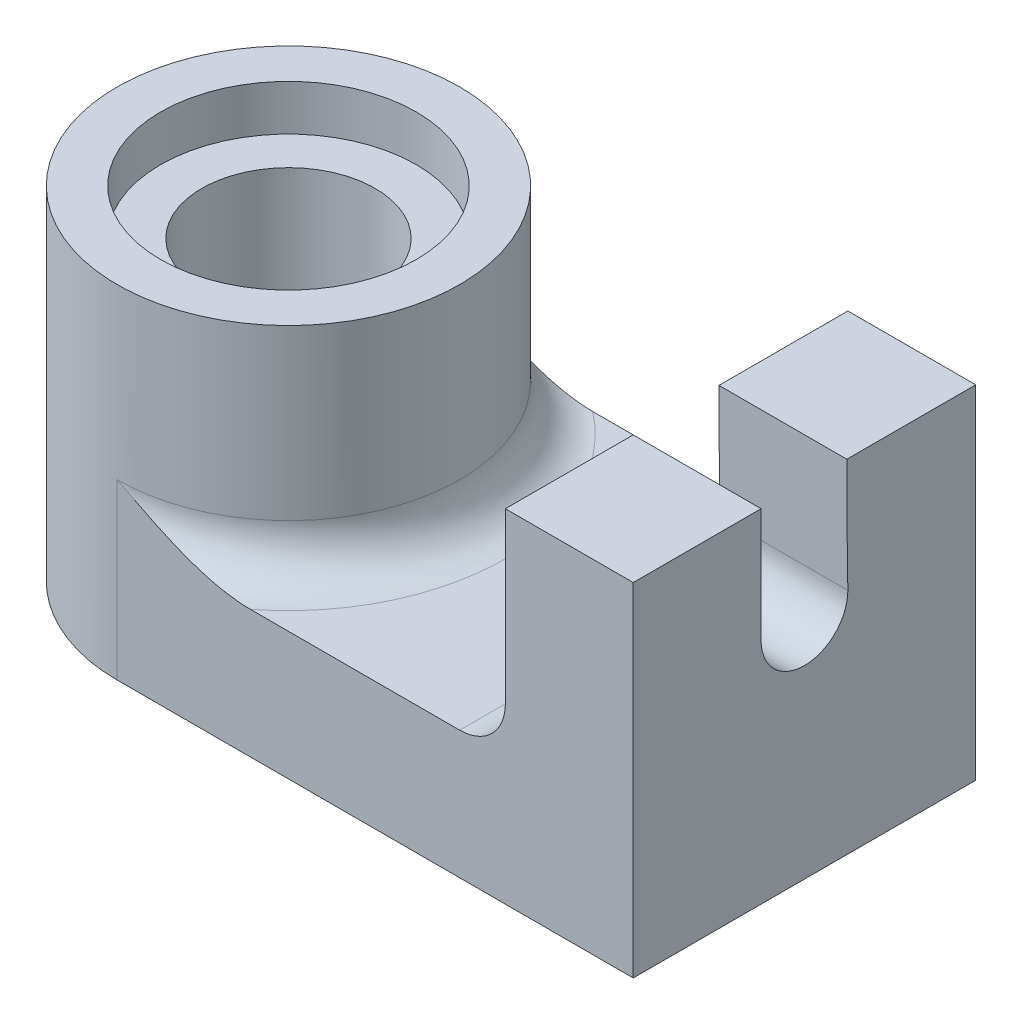
ISO-10303-21;
HEADER;
FILE_DESCRIPTION(('STEP AP214'),'2;1');
FILE_NAME('part.step','',(''),(''),'','','');
FILE_SCHEMA(('AUTOMOTIVE_DESIGN { 1 0 10303 214 1 1 1 1 }'));
ENDSEC;
DATA;
#1=APPLICATION_CONTEXT('core data for automotive mechanical design processes');
#2=APPLICATION_PROTOCOL_DEFINITION('international standard','automotive_design',2000,#1);
#3=PRODUCT_CONTEXT('',#1,'mechanical');
#4=PRODUCT('Part','Part','',(#3));
#5=PRODUCT_RELATED_PRODUCT_CATEGORY('part','',(#4));
#6=PRODUCT_DEFINITION_FORMATION('','',#4);
#7=PRODUCT_DEFINITION_CONTEXT('part definition',#1,'design');
#8=PRODUCT_DEFINITION('design','',#6,#7);
#9=PRODUCT_DEFINITION_SHAPE('','',#8);
#10=(LENGTH_UNIT() NAMED_UNIT(*) SI_UNIT(.MILLI.,.METRE.));
#11=(NAMED_UNIT(*) PLANE_ANGLE_UNIT() SI_UNIT($,.RADIAN.));
#12=(NAMED_UNIT(*) SI_UNIT($,.STERADIAN.) SOLID_ANGLE_UNIT());
#13=UNCERTAINTY_MEASURE_WITH_UNIT(LENGTH_MEASURE(1.E-05),#10,'distance_accuracy_value','');
#14=(GEOMETRIC_REPRESENTATION_CONTEXT(3) GLOBAL_UNCERTAINTY_ASSIGNED_CONTEXT((#13)) GLOBAL_UNIT_ASSIGNED_CONTEXT((#10,
#11,#12)) REPRESENTATION_CONTEXT('',''));
#15=CARTESIAN_POINT('',(0.,0.,0.));
#16=DIRECTION('',(0.,0.,1.));
#17=DIRECTION('',(1.,0.,0.));
#18=AXIS2_PLACEMENT_3D('',#15,#16,#17);
#19=CARTESIAN_POINT('',(0.,75.,0.));
#20=DIRECTION('',(0.,-1.,0.));
#21=DIRECTION('',(0.,0.,-1.));
#22=AXIS2_PLACEMENT_3D('',#19,#20,#21);
#23=CYLINDRICAL_SURFACE('',#22,19.);
#24=CARTESIAN_POINT('',(0.,65.,0.));
#25=DIRECTION('',(0.,1.,0.));
#26=DIRECTION('',(0.,0.,1.));
#27=AXIS2_PLACEMENT_3D('',#24,#25,#26);
#28=CIRCLE('',#27,19.);
#29=CARTESIAN_POINT('',(18.3303027798234,65.,5.));
#30=VERTEX_POINT('',#29);
#31=CARTESIAN_POINT('',(18.3303027798234,65.,-5.));
#32=VERTEX_POINT('',#31);
#33=EDGE_CURVE('E179',#30,#32,#28,.F.);
#34=ORIENTED_EDGE('',*,*,#33,.F.);
#35=DIRECTION('',(0.,1.,0.));
#36=VECTOR('',#35,1.);
#37=CARTESIAN_POINT('',(18.3303027798234,-35.,5.));
#38=LINE('',#37,#36);
#39=CARTESIAN_POINT('',(18.3303027798234,9.99999999999999,5.));
#40=VERTEX_POINT('',#39);
#41=EDGE_CURVE('E188',#40,#30,#38,.T.);
#42=ORIENTED_EDGE('',*,*,#41,.F.);
#43=CARTESIAN_POINT('',(0.,9.99999999999999,0.));
#44=DIRECTION('',(0.,-1.,0.));
#45=DIRECTION('',(0.,0.,-1.));
#46=AXIS2_PLACEMENT_3D('',#43,#44,#45);
#47=CIRCLE('',#46,19.);
#48=CARTESIAN_POINT('',(18.3303027798234,9.99999999999999,-5.));
#49=VERTEX_POINT('',#48);
#50=EDGE_CURVE('E197',#49,#40,#47,.F.);
#51=ORIENTED_EDGE('',*,*,#50,.F.);
#52=DIRECTION('',(0.,1.,0.));
#53=VECTOR('',#52,1.);
#54=CARTESIAN_POINT('',(18.3303027798234,-35.,-5.));
#55=LINE('',#54,#53);
#56=EDGE_CURVE('E57',#49,#32,#55,.T.);
#57=ORIENTED_EDGE('',*,*,#56,.T.);
#58=EDGE_LOOP('',(#34,#42,#51,#57));
#59=FACE_BOUND('',#58,.T.);
#60=ADVANCED_FACE('F40',(#59),#23,.F.);
#61=CARTESIAN_POINT('',(113.,0.,37.5));
#62=DIRECTION('',(-1.,0.,0.));
#63=DIRECTION('',(0.,0.,1.));
#64=AXIS2_PLACEMENT_3D('',#61,#62,#63);
#65=PLANE('',#64);
#66=CARTESIAN_POINT('',(113.,75.,-1401.91064311715));
#67=DIRECTION('',(1.,0.,0.));
#68=DIRECTION('',(0.,0.,-1.));
#69=AXIS2_PLACEMENT_3D('',#66,#67,#68);
#70=CIRCLE('',#69,1392.63505595181);
#71=CARTESIAN_POINT('',(113.,75.,-9.27558716533494));
#72=VERTEX_POINT('',#71);
#73=CARTESIAN_POINT('',(113.,49.999999999996,-9.5));
#74=VERTEX_POINT('',#73);
#75=EDGE_CURVE('E213',#72,#74,#70,.T.);
#76=ORIENTED_EDGE('',*,*,#75,.T.);
#77=CARTESIAN_POINT('',(113.,50.,0.));
#78=DIRECTION('',(1.,0.,0.));
#79=DIRECTION('',(0.,0.,-1.));
#80=AXIS2_PLACEMENT_3D('',#77,#78,#79);
#81=CIRCLE('',#80,9.5);
#82=CARTESIAN_POINT('',(113.,50.,9.5));
#83=VERTEX_POINT('',#82);
#84=EDGE_CURVE('E225',#83,#74,#81,.T.);
#85=ORIENTED_EDGE('',*,*,#84,.F.);
#86=DIRECTION('',(0.,-1.,0.));
#87=VECTOR('',#86,1.);
#88=CARTESIAN_POINT('',(113.,0.,9.49999999999999));
#89=LINE('',#88,#87);
#90=CARTESIAN_POINT('',(113.,75.,9.5));
#91=VERTEX_POINT('',#90);
#92=EDGE_CURVE('E221',#91,#83,#89,.T.);
#93=ORIENTED_EDGE('',*,*,#92,.F.);
#94=DIRECTION('',(0.,0.,-1.));
#95=VECTOR('',#94,1.);
#96=CARTESIAN_POINT('',(113.,75.,37.5));
#97=LINE('',#96,#95);
#98=CARTESIAN_POINT('',(113.,75.,37.5));
#99=VERTEX_POINT('',#98);
#100=EDGE_CURVE('E290',#99,#91,#97,.T.);
#101=ORIENTED_EDGE('',*,*,#100,.F.);
#102=DIRECTION('',(0.,1.,0.));
#103=VECTOR('',#102,1.);
#104=CARTESIAN_POINT('',(113.,0.,37.5));
#105=LINE('',#104,#103);
#106=CARTESIAN_POINT('',(113.,0.,37.5));
#107=VERTEX_POINT('',#106);
#108=EDGE_CURVE('E249',#107,#99,#105,.T.);
#109=ORIENTED_EDGE('',*,*,#108,.F.);
#110=DIRECTION('',(0.,0.,-1.));
#111=VECTOR('',#110,1.);
#112=CARTESIAN_POINT('',(113.,0.,37.5));
#113=LINE('',#112,#111);
#114=CARTESIAN_POINT('',(113.,0.,-37.5));
#115=VERTEX_POINT('',#114);
#116=EDGE_CURVE('E294',#107,#115,#113,.T.);
#117=ORIENTED_EDGE('',*,*,#116,.T.);
#118=DIRECTION('',(0.,1.,0.));
#119=VECTOR('',#118,1.);
#120=CARTESIAN_POINT('',(113.,0.,-37.5));
#121=LINE('',#120,#119);
#122=CARTESIAN_POINT('',(113.,75.,-37.5));
#123=VERTEX_POINT('',#122);
#124=EDGE_CURVE('E270',#115,#123,#121,.T.);
#125=ORIENTED_EDGE('',*,*,#124,.T.);
#126=EDGE_CURVE('E289',#72,#123,#97,.T.);
#127=ORIENTED_EDGE('',*,*,#126,.F.);
#128=EDGE_LOOP('',(#76,#85,#93,#101,#109,#117,#125,#127));
#129=FACE_BOUND('',#128,.T.);
#130=ADVANCED_FACE('F375',(#129),#65,.F.);
#131=CARTESIAN_POINT('',(113.,75.,37.5));
#132=DIRECTION('',(0.,-1.,0.));
#133=DIRECTION('',(0.,0.,-1.));
#134=AXIS2_PLACEMENT_3D('',#131,#132,#133);
#135=PLANE('',#134);
#136=DIRECTION('',(1.,0.,0.));
#137=VECTOR('',#136,1.);
#138=CARTESIAN_POINT('',(38.,75.,-9.27558716533494));
#139=LINE('',#138,#137);
#140=CARTESIAN_POINT('',(85.,75.,-9.27558716533494));
#141=VERTEX_POINT('',#140);
#142=EDGE_CURVE('E229',#141,#72,#139,.T.);
#143=ORIENTED_EDGE('',*,*,#142,.T.);
#144=ORIENTED_EDGE('',*,*,#126,.T.);
#145=DIRECTION('',(-1.,0.,0.));
#146=VECTOR('',#145,1.);
#147=CARTESIAN_POINT('',(113.,75.,-37.5));
#148=LINE('',#147,#146);
#149=CARTESIAN_POINT('',(85.,75.,-37.5));
#150=VERTEX_POINT('',#149);
#151=EDGE_CURVE('E274',#123,#150,#148,.T.);
#152=ORIENTED_EDGE('',*,*,#151,.T.);
#153=DIRECTION('',(0.,0.,-1.));
#154=VECTOR('',#153,1.);
#155=CARTESIAN_POINT('',(85.,75.,37.5));
#156=LINE('',#155,#154);
#157=EDGE_CURVE('E263',#141,#150,#156,.T.);
#158=ORIENTED_EDGE('',*,*,#157,.F.);
#159=EDGE_LOOP('',(#143,#144,#152,#158));
#160=FACE_BOUND('',#159,.T.);
#161=ADVANCED_FACE('F370',(#160),#135,.F.);
#162=CARTESIAN_POINT('',(85.,75.,37.5));
#163=DIRECTION('',(1.,0.,0.));
#164=DIRECTION('',(0.,0.,-1.));
#165=AXIS2_PLACEMENT_3D('',#162,#163,#164);
#166=PLANE('',#165);
#167=DIRECTION('',(0.,-1.,0.));
#168=VECTOR('',#167,1.);
#169=CARTESIAN_POINT('',(85.,75.,-37.5));
#170=LINE('',#169,#168);
#171=CARTESIAN_POINT('',(85.,38.,-37.5));
#172=VERTEX_POINT('',#171);
#173=EDGE_CURVE('E278',#150,#172,#170,.T.);
#174=ORIENTED_EDGE('',*,*,#173,.T.);
#175=DIRECTION('',(0.,0.,-1.));
#176=VECTOR('',#175,1.);
#177=CARTESIAN_POINT('',(85.,38.,37.5));
#178=LINE('',#177,#176);
#179=CARTESIAN_POINT('',(85.,38.,37.5));
#180=VERTEX_POINT('',#179);
#181=EDGE_CURVE('E322',#172,#180,#178,.F.);
#182=ORIENTED_EDGE('',*,*,#181,.T.);
#183=DIRECTION('',(0.,-1.,0.));
#184=VECTOR('',#183,1.);
#185=CARTESIAN_POINT('',(85.,75.,37.5));
#186=LINE('',#185,#184);
#187=CARTESIAN_POINT('',(85.,75.,37.5));
#188=VERTEX_POINT('',#187);
#189=EDGE_CURVE('E255',#188,#180,#186,.T.);
#190=ORIENTED_EDGE('',*,*,#189,.F.);
#191=CARTESIAN_POINT('',(85.,75.,9.5));
#192=VERTEX_POINT('',#191);
#193=EDGE_CURVE('E285',#188,#192,#156,.T.);
#194=ORIENTED_EDGE('',*,*,#193,.T.);
#195=DIRECTION('',(0.,-1.,0.));
#196=VECTOR('',#195,1.);
#197=CARTESIAN_POINT('',(85.,75.,9.5));
#198=LINE('',#197,#196);
#199=CARTESIAN_POINT('',(85.,50.,9.49999999999999));
#200=VERTEX_POINT('',#199);
#201=EDGE_CURVE('E298',#192,#200,#198,.T.);
#202=ORIENTED_EDGE('',*,*,#201,.T.);
#203=CARTESIAN_POINT('',(85.,50.,0.));
#204=DIRECTION('',(1.,0.,0.));
#205=DIRECTION('',(0.,0.,-1.));
#206=AXIS2_PLACEMENT_3D('',#203,#204,#205);
#207=CIRCLE('',#206,9.5);
#208=CARTESIAN_POINT('',(85.,49.999999999996,-9.5));
#209=VERTEX_POINT('',#208);
#210=EDGE_CURVE('E302',#200,#209,#207,.T.);
#211=ORIENTED_EDGE('',*,*,#210,.T.);
#212=CARTESIAN_POINT('',(85.,75.,-1401.91064311715));
#213=DIRECTION('',(1.,0.,0.));
#214=DIRECTION('',(0.,0.,-1.));
#215=AXIS2_PLACEMENT_3D('',#212,#213,#214);
#216=CIRCLE('',#215,1392.63505595181);
#217=EDGE_CURVE('E306',#141,#209,#216,.T.);
#218=ORIENTED_EDGE('',*,*,#217,.F.);
#219=ORIENTED_EDGE('',*,*,#157,.T.);
#220=EDGE_LOOP('',(#174,#182,#190,#194,#202,#211,#218,#219));
#221=FACE_BOUND('',#220,.T.);
#222=ADVANCED_FACE('F366',(#221),#166,.F.);
#223=CARTESIAN_POINT('',(0.,0.,37.5));
#224=DIRECTION('',(0.,1.,0.));
#225=DIRECTION('',(0.,0.,1.));
#226=AXIS2_PLACEMENT_3D('',#223,#224,#225);
#227=PLANE('',#226);
#228=CARTESIAN_POINT('',(0.,0.,0.));
#229=DIRECTION('',(0.,1.,0.));
#230=DIRECTION('',(0.,0.,1.));
#231=AXIS2_PLACEMENT_3D('',#228,#229,#230);
#232=CIRCLE('',#231,28.);
#233=CARTESIAN_POINT('',(0.,0.,28.));
#234=VERTEX_POINT('',#233);
#235=EDGE_CURVE('E187',#234,#234,#232,.T.);
#236=ORIENTED_EDGE('',*,*,#235,.T.);
#237=EDGE_LOOP('',(#236));
#238=FACE_BOUND('',#237,.T.);
#239=DIRECTION('',(1.,0.,0.));
#240=VECTOR('',#239,1.);
#241=CARTESIAN_POINT('',(0.,0.,37.5));
#242=LINE('',#241,#240);
#243=CARTESIAN_POINT('',(0.,0.,37.5));
#244=VERTEX_POINT('',#243);
#245=EDGE_CURVE('E245',#244,#107,#242,.T.);
#246=ORIENTED_EDGE('',*,*,#245,.F.);
#247=CARTESIAN_POINT('',(0.,0.,0.));
#248=DIRECTION('',(0.,-1.,0.));
#249=DIRECTION('',(0.,0.,-1.));
#250=AXIS2_PLACEMENT_3D('',#247,#248,#249);
#251=CIRCLE('',#250,37.5);
#252=CARTESIAN_POINT('',(0.,0.,-37.5));
#253=VERTEX_POINT('',#252);
#254=EDGE_CURVE('E214',#244,#253,#251,.T.);
#255=ORIENTED_EDGE('',*,*,#254,.T.);
#256=DIRECTION('',(1.,0.,0.));
#257=VECTOR('',#256,1.);
#258=CARTESIAN_POINT('',(0.,0.,-37.5));
#259=LINE('',#258,#257);
#260=EDGE_CURVE('E267',#253,#115,#259,.T.);
#261=ORIENTED_EDGE('',*,*,#260,.T.);
#262=ORIENTED_EDGE('',*,*,#116,.F.);
#263=EDGE_LOOP('',(#246,#255,#261,#262));
#264=FACE_BOUND('',#263,.T.);
#265=ADVANCED_FACE('F369',(#238,#264),#227,.F.);
#266=ORIENTED_EDGE('',*,*,#100,.T.);
#267=DIRECTION('',(1.,0.,0.));
#268=VECTOR('',#267,1.);
#269=CARTESIAN_POINT('',(38.,75.,9.5));
#270=LINE('',#269,#268);
#271=EDGE_CURVE('E237',#192,#91,#270,.T.);
#272=ORIENTED_EDGE('',*,*,#271,.F.);
#273=ORIENTED_EDGE('',*,*,#193,.F.);
#274=DIRECTION('',(-1.,0.,0.));
#275=VECTOR('',#274,1.);
#276=CARTESIAN_POINT('',(113.,75.,37.5));
#277=LINE('',#276,#275);
#278=EDGE_CURVE('E252',#99,#188,#277,.T.);
#279=ORIENTED_EDGE('',*,*,#278,.F.);
#280=EDGE_LOOP('',(#266,#272,#273,#279));
#281=FACE_BOUND('',#280,.T.);
#282=ADVANCED_FACE('F364',(#281),#135,.F.);
#283=CARTESIAN_POINT('',(0.,28.,37.5));
#284=DIRECTION('',(0.,-1.,0.));
#285=DIRECTION('',(0.,0.,-1.));
#286=AXIS2_PLACEMENT_3D('',#283,#284,#285);
#287=PLANE('',#286);
#288=DIRECTION('',(-1.,0.,0.));
#289=VECTOR('',#288,1.);
#290=CARTESIAN_POINT('',(0.,28.,37.5));
#291=LINE('',#290,#289);
#292=CARTESIAN_POINT('',(75.,28.,37.5));
#293=VERTEX_POINT('',#292);
#294=CARTESIAN_POINT('',(29.1547594742265,28.,37.5));
#295=VERTEX_POINT('',#294);
#296=EDGE_CURVE('E259',#293,#295,#291,.T.);
#297=ORIENTED_EDGE('',*,*,#296,.F.);
#298=DIRECTION('',(0.,0.,-1.));
#299=VECTOR('',#298,1.);
#300=CARTESIAN_POINT('',(75.,28.,-37.5));
#301=LINE('',#300,#299);
#302=CARTESIAN_POINT('',(75.,28.,-37.5));
#303=VERTEX_POINT('',#302);
#304=EDGE_CURVE('E318',#293,#303,#301,.T.);
#305=ORIENTED_EDGE('',*,*,#304,.T.);
#306=DIRECTION('',(-1.,0.,0.));
#307=VECTOR('',#306,1.);
#308=CARTESIAN_POINT('',(0.,28.,-37.5));
#309=LINE('',#308,#307);
#310=CARTESIAN_POINT('',(29.1547594742265,28.,-37.5));
#311=VERTEX_POINT('',#310);
#312=EDGE_CURVE('E246',#303,#311,#309,.T.);
#313=ORIENTED_EDGE('',*,*,#312,.T.);
#314=CARTESIAN_POINT('',(0.,28.,0.));
#315=DIRECTION('',(0.,-1.,0.));
#316=DIRECTION('',(0.,0.,-1.));
#317=AXIS2_PLACEMENT_3D('',#314,#315,#316);
#318=CIRCLE('',#317,47.5);
#319=EDGE_CURVE('E309',#311,#295,#318,.T.);
#320=ORIENTED_EDGE('',*,*,#319,.T.);
#321=EDGE_LOOP('',(#297,#305,#313,#320));
#322=FACE_BOUND('',#321,.T.);
#323=ADVANCED_FACE('F354',(#322),#287,.F.);
#324=CARTESIAN_POINT('',(0.,0.,37.5));
#325=DIRECTION('',(0.,0.,1.));
#326=DIRECTION('',(1.,0.,0.));
#327=AXIS2_PLACEMENT_3D('',#324,#325,#326);
#328=PLANE('',#327);
#329=DIRECTION('',(0.,-1.,0.));
#330=VECTOR('',#329,1.);
#331=CARTESIAN_POINT('',(0.,28.,37.5));
#332=LINE('',#331,#330);
#333=CARTESIAN_POINT('',(0.,38.,37.5));
#334=VERTEX_POINT('',#333);
#335=EDGE_CURVE('E65',#334,#244,#332,.T.);
#336=ORIENTED_EDGE('',*,*,#335,.T.);
#337=ORIENTED_EDGE('',*,*,#245,.T.);
#338=ORIENTED_EDGE('',*,*,#108,.T.);
#339=ORIENTED_EDGE('',*,*,#278,.T.);
#340=ORIENTED_EDGE('',*,*,#189,.T.);
#341=CARTESIAN_POINT('',(75.,38.,37.5));
#342=DIRECTION('',(0.,0.,1.));
#343=DIRECTION('',(1.,0.,0.));
#344=AXIS2_PLACEMENT_3D('',#341,#342,#343);
#345=CIRCLE('',#344,10.);
#346=EDGE_CURVE('E331',#180,#293,#345,.F.);
#347=ORIENTED_EDGE('',*,*,#346,.T.);
#348=ORIENTED_EDGE('',*,*,#296,.T.);
#349=CARTESIAN_POINT('',(29.1547594742265,28.,37.5));
#350=CARTESIAN_POINT('',(28.7281693213198,28.0000213351898,37.5));
#351=CARTESIAN_POINT('',(28.3016560019937,28.0102823714577,37.5));
#352=CARTESIAN_POINT('',(27.4496484749143,28.0497436177263,37.5));
#353=CARTESIAN_POINT('',(27.0241539567032,28.0789370387655,37.5));
#354=CARTESIAN_POINT('',(26.1755938350462,28.1546490977707,37.5));
#355=CARTESIAN_POINT('',(25.752525072775,28.2011328970016,37.5));
#356=CARTESIAN_POINT('',(24.9084309647445,28.310057073569,37.5));
#357=CARTESIAN_POINT('',(24.4874058252895,28.3724990290975,37.5));
#358=CARTESIAN_POINT('',(23.23837309624,28.580089301681,37.5));
#359=CARTESIAN_POINT('',(22.4138500474065,28.7465122101826,37.5));
#360=CARTESIAN_POINT('',(20.7758132686119,29.1277255658466,37.5));
#361=CARTESIAN_POINT('',(19.9623061865877,29.3425439504548,37.5));
#362=CARTESIAN_POINT('',(18.3204624353044,29.8206084774625,37.5));
#363=CARTESIAN_POINT('',(17.4925271858555,30.0852230909798,37.5));
#364=CARTESIAN_POINT('',(15.8489631392553,30.650459531203,37.5));
#365=CARTESIAN_POINT('',(15.033336958782,30.9510888958713,37.5));
#366=CARTESIAN_POINT('',(13.4132111825351,31.5819324738864,37.5));
#367=CARTESIAN_POINT('',(12.6087174048153,31.9121615291628,37.5));
#368=CARTESIAN_POINT('',(11.0098130339508,32.5962759351075,37.5));
#369=CARTESIAN_POINT('',(10.2154035091362,32.9501637677166,37.5));
#370=CARTESIAN_POINT('',(7.83689487857638,34.0428931216585,37.5));
#371=CARTESIAN_POINT('',(6.265636805929,34.8095165085072,37.5000000000001));
#372=CARTESIAN_POINT('',(3.14103857078369,36.3781249222882,37.4999999999999));
#373=CARTESIAN_POINT('',(1.58770134820684,37.1801156500333,37.4999999999997));
#374=CARTESIAN_POINT('',(0.0229415743868301,37.988153022757,37.5));
#375=CARTESIAN_POINT('',(0.0114707876984453,37.9940765115441,37.5));
#376=CARTESIAN_POINT('',(0.,38.,37.5));
#377=B_SPLINE_CURVE_WITH_KNOTS('',3,(#349,#350,#351,#352,#353,#354,#355,#356,#357,#358,#359,
#360,#361,#362,#363,#364,#365,#366,#367,#368,#369,#370,#371,#372,#373,#374,#375,#376),
.UNSPECIFIED.,.F.,.F.,(4,2,2,2,2,2,2,2,2,2,2,2,2,4),(0.,1.2795357137768,2.5586128525283,
3.83512659170381,5.11176662141012,7.63330150529883,10.156295752437,12.7628652516186,
15.3699812675266,17.9784119403805,20.5871166831917,25.8307743780252,31.0752804024462,
31.1140102359086),.UNSPECIFIED.);
#378=EDGE_CURVE('E334',#295,#334,#377,.T.);
#379=ORIENTED_EDGE('',*,*,#378,.T.);
#380=EDGE_LOOP('',(#336,#337,#338,#339,#340,#347,#348,#379));
#381=FACE_BOUND('',#380,.T.);
#382=ADVANCED_FACE('F349',(#381),#328,.T.);
#383=CARTESIAN_POINT('',(0.,0.,-37.5));
#384=DIRECTION('',(0.,0.,1.));
#385=DIRECTION('',(1.,0.,0.));
#386=AXIS2_PLACEMENT_3D('',#383,#384,#385);
#387=PLANE('',#386);
#388=DIRECTION('',(0.,-1.,0.));
#389=VECTOR('',#388,1.);
#390=CARTESIAN_POINT('',(0.,28.,-37.5));
#391=LINE('',#390,#389);
#392=CARTESIAN_POINT('',(0.,38.,-37.5));
#393=VERTEX_POINT('',#392);
#394=EDGE_CURVE('E233',#393,#253,#391,.T.);
#395=ORIENTED_EDGE('',*,*,#394,.F.);
#396=CARTESIAN_POINT('',(29.1547594742265,28.,-37.5));
#397=CARTESIAN_POINT('',(28.7281693213198,28.0000213351898,-37.5));
#398=CARTESIAN_POINT('',(28.3016560019937,28.0102823714577,-37.5));
#399=CARTESIAN_POINT('',(27.4496484749143,28.0497436177263,-37.5));
#400=CARTESIAN_POINT('',(27.0241539567032,28.0789370387655,-37.5));
#401=CARTESIAN_POINT('',(26.1755938350462,28.1546490977707,-37.5));
#402=CARTESIAN_POINT('',(25.752525072775,28.2011328970016,-37.5));
#403=CARTESIAN_POINT('',(24.9084309647445,28.310057073569,-37.5));
#404=CARTESIAN_POINT('',(24.4874058252895,28.3724990290975,-37.5));
#405=CARTESIAN_POINT('',(23.23837309624,28.580089301681,-37.5));
#406=CARTESIAN_POINT('',(22.4138500474065,28.7465122101826,-37.5));
#407=CARTESIAN_POINT('',(20.7758132686119,29.1277255658466,-37.5));
#408=CARTESIAN_POINT('',(19.9623061865877,29.3425439504548,-37.5));
#409=CARTESIAN_POINT('',(18.3204624353044,29.8206084774625,-37.5));
#410=CARTESIAN_POINT('',(17.4925271858555,30.0852230909798,-37.5));
#411=CARTESIAN_POINT('',(15.8489631392553,30.650459531203,-37.5));
#412=CARTESIAN_POINT('',(15.033336958782,30.9510888958713,-37.5));
#413=CARTESIAN_POINT('',(13.4132111825351,31.5819324738864,-37.5));
#414=CARTESIAN_POINT('',(12.6087174048153,31.9121615291628,-37.5));
#415=CARTESIAN_POINT('',(11.0098130339508,32.5962759351075,-37.5));
#416=CARTESIAN_POINT('',(10.2154035091362,32.9501637677166,-37.5));
#417=CARTESIAN_POINT('',(7.83689487857638,34.0428931216585,-37.5));
#418=CARTESIAN_POINT('',(6.265636805929,34.8095165085072,-37.5000000000001));
#419=CARTESIAN_POINT('',(3.14103857078369,36.3781249222882,-37.4999999999999));
#420=CARTESIAN_POINT('',(1.58770134820684,37.1801156500333,-37.4999999999997));
#421=CARTESIAN_POINT('',(0.0229415743868301,37.988153022757,-37.5));
#422=CARTESIAN_POINT('',(0.0114707876984453,37.9940765115441,-37.5));
#423=CARTESIAN_POINT('',(0.,38.,-37.5));
#424=B_SPLINE_CURVE_WITH_KNOTS('',3,(#396,#397,#398,#399,#400,#401,#402,#403,#404,#405,#406,
#407,#408,#409,#410,#411,#412,#413,#414,#415,#416,#417,#418,#419,#420,#421,#422,#423),
.UNSPECIFIED.,.F.,.F.,(4,2,2,2,2,2,2,2,2,2,2,2,2,4),(0.,1.2795357137768,2.5586128525283,
3.83512659170381,5.11176662141012,7.63330150529883,10.156295752437,12.7628652516186,
15.3699812675266,17.9784119403805,20.5871166831917,25.8307743780252,31.0752804024462,
31.1140102359086),.UNSPECIFIED.);
#425=EDGE_CURVE('E342',#393,#311,#424,.F.);
#426=ORIENTED_EDGE('',*,*,#425,.T.);
#427=ORIENTED_EDGE('',*,*,#312,.F.);
#428=CARTESIAN_POINT('',(75.,38.,-37.5));
#429=DIRECTION('',(0.,0.,1.));
#430=DIRECTION('',(1.,0.,0.));
#431=AXIS2_PLACEMENT_3D('',#428,#429,#430);
#432=CIRCLE('',#431,10.);
#433=EDGE_CURVE('E328',#303,#172,#432,.T.);
#434=ORIENTED_EDGE('',*,*,#433,.T.);
#435=ORIENTED_EDGE('',*,*,#173,.F.);
#436=ORIENTED_EDGE('',*,*,#151,.F.);
#437=ORIENTED_EDGE('',*,*,#124,.F.);
#438=ORIENTED_EDGE('',*,*,#260,.F.);
#439=EDGE_LOOP('',(#395,#426,#427,#434,#435,#436,#437,#438));
#440=FACE_BOUND('',#439,.T.);
#441=ADVANCED_FACE('F353',(#440),#387,.F.);
#442=CARTESIAN_POINT('',(38.,75.,-1401.91064311715));
#443=DIRECTION('',(1.,0.,0.));
#444=DIRECTION('',(0.,0.,-1.));
#445=AXIS2_PLACEMENT_3D('',#442,#443,#444);
#446=CYLINDRICAL_SURFACE('',#445,1392.63505595181);
#447=ORIENTED_EDGE('',*,*,#217,.T.);
#448=DIRECTION('',(1.,0.,0.));
#449=VECTOR('',#448,1.);
#450=CARTESIAN_POINT('',(38.,49.999999999996,-9.5));
#451=LINE('',#450,#449);
#452=EDGE_CURVE('E230',#209,#74,#451,.T.);
#453=ORIENTED_EDGE('',*,*,#452,.T.);
#454=ORIENTED_EDGE('',*,*,#75,.F.);
#455=ORIENTED_EDGE('',*,*,#142,.F.);
#456=EDGE_LOOP('',(#447,#453,#454,#455));
#457=FACE_BOUND('',#456,.T.);
#458=ADVANCED_FACE('F356',(#457),#446,.T.);
#459=CARTESIAN_POINT('',(38.,50.,0.));
#460=DIRECTION('',(1.,0.,0.));
#461=DIRECTION('',(0.,0.,-1.));
#462=AXIS2_PLACEMENT_3D('',#459,#460,#461);
#463=CYLINDRICAL_SURFACE('',#462,9.5);
#464=DIRECTION('',(1.,0.,0.));
#465=VECTOR('',#464,1.);
#466=CARTESIAN_POINT('',(38.,50.,9.5));
#467=LINE('',#466,#465);
#468=EDGE_CURVE('E234',#200,#83,#467,.T.);
#469=ORIENTED_EDGE('',*,*,#468,.T.);
#470=ORIENTED_EDGE('',*,*,#84,.T.);
#471=ORIENTED_EDGE('',*,*,#452,.F.);
#472=ORIENTED_EDGE('',*,*,#210,.F.);
#473=EDGE_LOOP('',(#469,#470,#471,#472));
#474=FACE_BOUND('',#473,.T.);
#475=ADVANCED_FACE('F412',(#474),#463,.F.);
#476=CARTESIAN_POINT('',(38.,0.,9.49999999999999));
#477=DIRECTION('',(0.,0.,1.));
#478=DIRECTION('',(0.,-1.,0.));
#479=AXIS2_PLACEMENT_3D('',#476,#477,#478);
#480=PLANE('',#479);
#481=ORIENTED_EDGE('',*,*,#271,.T.);
#482=ORIENTED_EDGE('',*,*,#92,.T.);
#483=ORIENTED_EDGE('',*,*,#468,.F.);
#484=ORIENTED_EDGE('',*,*,#201,.F.);
#485=EDGE_LOOP('',(#481,#482,#483,#484));
#486=FACE_BOUND('',#485,.T.);
#487=ADVANCED_FACE('F410',(#486),#480,.F.);
#488=CARTESIAN_POINT('',(0.,75.,0.));
#489=DIRECTION('',(0.,-1.,0.));
#490=DIRECTION('',(0.,0.,-1.));
#491=AXIS2_PLACEMENT_3D('',#488,#489,#490);
#492=CYLINDRICAL_SURFACE('',#491,37.5);
#493=CARTESIAN_POINT('',(0.,75.,0.));
#494=DIRECTION('',(0.,-1.,0.));
#495=DIRECTION('',(0.,0.,-1.));
#496=AXIS2_PLACEMENT_3D('',#493,#494,#495);
#497=CIRCLE('',#496,37.5);
#498=CARTESIAN_POINT('',(0.,75.,-37.5));
#499=VERTEX_POINT('',#498);
#500=EDGE_CURVE('E209',#499,#499,#497,.T.);
#501=ORIENTED_EDGE('',*,*,#500,.T.);
#502=EDGE_LOOP('',(#501));
#503=FACE_BOUND('',#502,.T.);
#504=ORIENTED_EDGE('',*,*,#335,.F.);
#505=CARTESIAN_POINT('',(0.,38.,0.));
#506=DIRECTION('',(0.,-1.,0.));
#507=DIRECTION('',(0.,0.,-1.));
#508=AXIS2_PLACEMENT_3D('',#505,#506,#507);
#509=CIRCLE('',#508,37.5);
#510=EDGE_CURVE('E325',#334,#393,#509,.F.);
#511=ORIENTED_EDGE('',*,*,#510,.T.);
#512=ORIENTED_EDGE('',*,*,#394,.T.);
#513=ORIENTED_EDGE('',*,*,#254,.F.);
#514=EDGE_LOOP('',(#504,#511,#512,#513));
#515=FACE_BOUND('',#514,.T.);
#516=ADVANCED_FACE('F406',(#503,#515),#492,.T.);
#517=CARTESIAN_POINT('',(0.,75.,0.));
#518=DIRECTION('',(0.,-1.,0.));
#519=DIRECTION('',(0.,0.,-1.));
#520=AXIS2_PLACEMENT_3D('',#517,#518,#519);
#521=PLANE('',#520);
#522=CARTESIAN_POINT('',(0.,75.,0.));
#523=DIRECTION('',(0.,1.,0.));
#524=DIRECTION('',(0.,0.,1.));
#525=AXIS2_PLACEMENT_3D('',#522,#523,#524);
#526=CIRCLE('',#525,28.);
#527=CARTESIAN_POINT('',(0.,75.,28.));
#528=VERTEX_POINT('',#527);
#529=EDGE_CURVE('E205',#528,#528,#526,.T.);
#530=ORIENTED_EDGE('',*,*,#529,.F.);
#531=EDGE_LOOP('',(#530));
#532=FACE_BOUND('',#531,.T.);
#533=ORIENTED_EDGE('',*,*,#500,.F.);
#534=EDGE_LOOP('',(#533));
#535=FACE_BOUND('',#534,.T.);
#536=ADVANCED_FACE('F403',(#532,#535),#521,.F.);
#537=CARTESIAN_POINT('',(0.,65.,0.));
#538=DIRECTION('',(0.,1.,0.));
#539=DIRECTION('',(0.,0.,1.));
#540=AXIS2_PLACEMENT_3D('',#537,#538,#539);
#541=PLANE('',#540);
#542=DIRECTION('',(1.,0.,0.));
#543=VECTOR('',#542,1.);
#544=CARTESIAN_POINT('',(18.3303027798234,65.,5.));
#545=LINE('',#544,#543);
#546=CARTESIAN_POINT('',(22.,65.,5.));
#547=VERTEX_POINT('',#546);
#548=EDGE_CURVE('E163',#30,#547,#545,.T.);
#549=ORIENTED_EDGE('',*,*,#548,.F.);
#550=ORIENTED_EDGE('',*,*,#33,.T.);
#551=DIRECTION('',(-1.,0.,0.));
#552=VECTOR('',#551,1.);
#553=CARTESIAN_POINT('',(18.3303027798234,65.,-5.));
#554=LINE('',#553,#552);
#555=CARTESIAN_POINT('',(22.,65.,-5.));
#556=VERTEX_POINT('',#555);
#557=EDGE_CURVE('E158',#556,#32,#554,.T.);
#558=ORIENTED_EDGE('',*,*,#557,.F.);
#559=DIRECTION('',(0.,0.,-1.));
#560=VECTOR('',#559,1.);
#561=CARTESIAN_POINT('',(22.,65.,-5.));
#562=LINE('',#561,#560);
#563=EDGE_CURVE('E166',#547,#556,#562,.T.);
#564=ORIENTED_EDGE('',*,*,#563,.F.);
#565=EDGE_LOOP('',(#549,#550,#558,#564));
#566=FACE_BOUND('',#565,.T.);
#567=CARTESIAN_POINT('',(0.,65.,0.));
#568=DIRECTION('',(0.,1.,0.));
#569=DIRECTION('',(0.,0.,1.));
#570=AXIS2_PLACEMENT_3D('',#567,#568,#569);
#571=CIRCLE('',#570,28.);
#572=CARTESIAN_POINT('',(0.,65.,28.));
#573=VERTEX_POINT('',#572);
#574=EDGE_CURVE('E201',#573,#573,#571,.T.);
#575=ORIENTED_EDGE('',*,*,#574,.T.);
#576=EDGE_LOOP('',(#575));
#577=FACE_BOUND('',#576,.T.);
#578=ADVANCED_FACE('F176',(#566,#577),#541,.T.);
#579=CARTESIAN_POINT('',(0.,65.,0.));
#580=DIRECTION('',(0.,1.,0.));
#581=DIRECTION('',(0.,0.,1.));
#582=AXIS2_PLACEMENT_3D('',#579,#580,#581);
#583=CYLINDRICAL_SURFACE('',#582,28.);
#584=ORIENTED_EDGE('',*,*,#574,.F.);
#585=EDGE_LOOP('',(#584));
#586=FACE_BOUND('',#585,.T.);
#587=ORIENTED_EDGE('',*,*,#529,.T.);
#588=EDGE_LOOP('',(#587));
#589=FACE_BOUND('',#588,.T.);
#590=ADVANCED_FACE('F401',(#586,#589),#583,.F.);
#591=CARTESIAN_POINT('',(0.,10.,0.));
#592=DIRECTION('',(0.,-1.,0.));
#593=DIRECTION('',(0.,0.,1.));
#594=AXIS2_PLACEMENT_3D('',#591,#592,#593);
#595=PLANE('',#594);
#596=DIRECTION('',(-1.,0.,0.));
#597=VECTOR('',#596,1.);
#598=CARTESIAN_POINT('',(0.,10.,5.));
#599=LINE('',#598,#597);
#600=CARTESIAN_POINT('',(22.,9.99999999999999,5.));
#601=VERTEX_POINT('',#600);
#602=EDGE_CURVE('E12',#601,#40,#599,.T.);
#603=ORIENTED_EDGE('',*,*,#602,.F.);
#604=DIRECTION('',(0.,0.,1.));
#605=VECTOR('',#604,1.);
#606=CARTESIAN_POINT('',(22.,10.,0.));
#607=LINE('',#606,#605);
#608=CARTESIAN_POINT('',(22.,9.99999999999999,-5.));
#609=VERTEX_POINT('',#608);
#610=EDGE_CURVE('E50',#609,#601,#607,.T.);
#611=ORIENTED_EDGE('',*,*,#610,.F.);
#612=DIRECTION('',(1.,0.,0.));
#613=VECTOR('',#612,1.);
#614=CARTESIAN_POINT('',(0.,10.,-5.));
#615=LINE('',#614,#613);
#616=EDGE_CURVE('E159',#49,#609,#615,.T.);
#617=ORIENTED_EDGE('',*,*,#616,.F.);
#618=ORIENTED_EDGE('',*,*,#50,.T.);
#619=EDGE_LOOP('',(#603,#611,#617,#618));
#620=FACE_BOUND('',#619,.T.);
#621=CARTESIAN_POINT('',(0.,10.,0.));
#622=DIRECTION('',(0.,1.,0.));
#623=DIRECTION('',(0.,0.,1.));
#624=AXIS2_PLACEMENT_3D('',#621,#622,#623);
#625=CIRCLE('',#624,28.);
#626=CARTESIAN_POINT('',(0.,10.,28.));
#627=VERTEX_POINT('',#626);
#628=EDGE_CURVE('E193',#627,#627,#625,.T.);
#629=ORIENTED_EDGE('',*,*,#628,.F.);
#630=EDGE_LOOP('',(#629));
#631=FACE_BOUND('',#630,.T.);
#632=ADVANCED_FACE('F390',(#620,#631),#595,.T.);
#633=CARTESIAN_POINT('',(0.,10.,0.));
#634=DIRECTION('',(0.,-1.,0.));
#635=DIRECTION('',(0.,0.,-1.));
#636=AXIS2_PLACEMENT_3D('',#633,#634,#635);
#637=CYLINDRICAL_SURFACE('',#636,28.);
#638=ORIENTED_EDGE('',*,*,#628,.T.);
#639=EDGE_LOOP('',(#638));
#640=FACE_BOUND('',#639,.T.);
#641=ORIENTED_EDGE('',*,*,#235,.F.);
#642=EDGE_LOOP('',(#641));
#643=FACE_BOUND('',#642,.T.);
#644=ADVANCED_FACE('F383',(#640,#643),#637,.F.);
#645=CARTESIAN_POINT('',(75.,38.,37.5));
#646=DIRECTION('',(0.,0.,1.));
#647=DIRECTION('',(1.,0.,0.));
#648=AXIS2_PLACEMENT_3D('',#645,#646,#647);
#649=CYLINDRICAL_SURFACE('',#648,10.);
#650=ORIENTED_EDGE('',*,*,#346,.F.);
#651=ORIENTED_EDGE('',*,*,#181,.F.);
#652=ORIENTED_EDGE('',*,*,#433,.F.);
#653=ORIENTED_EDGE('',*,*,#304,.F.);
#654=EDGE_LOOP('',(#650,#651,#652,#653));
#655=FACE_BOUND('',#654,.T.);
#656=ADVANCED_FACE('F381',(#655),#649,.F.);
#657=CARTESIAN_POINT('',(0.,38.,0.));
#658=DIRECTION('',(0.,-1.,0.));
#659=DIRECTION('',(0.,0.,-1.));
#660=AXIS2_PLACEMENT_3D('',#657,#658,#659);
#661=TOROIDAL_SURFACE('',#660,47.5,10.);
#662=ORIENTED_EDGE('',*,*,#425,.F.);
#663=ORIENTED_EDGE('',*,*,#510,.F.);
#664=ORIENTED_EDGE('',*,*,#378,.F.);
#665=ORIENTED_EDGE('',*,*,#319,.F.);
#666=EDGE_LOOP('',(#662,#663,#664,#665));
#667=FACE_BOUND('',#666,.T.);
#668=ADVANCED_FACE('F42',(#667),#661,.F.);
#669=CARTESIAN_POINT('',(22.,-35.,-5.));
#670=DIRECTION('',(1.,0.,0.));
#671=DIRECTION('',(0.,0.,-1.));
#672=AXIS2_PLACEMENT_3D('',#669,#670,#671);
#673=PLANE('',#672);
#674=ORIENTED_EDGE('',*,*,#610,.T.);
#675=DIRECTION('',(0.,1.,0.));
#676=VECTOR('',#675,1.);
#677=CARTESIAN_POINT('',(22.,-35.,5.));
#678=LINE('',#677,#676);
#679=EDGE_CURVE('E169',#601,#547,#678,.T.);
#680=ORIENTED_EDGE('',*,*,#679,.T.);
#681=ORIENTED_EDGE('',*,*,#563,.T.);
#682=DIRECTION('',(0.,1.,0.));
#683=VECTOR('',#682,1.);
#684=CARTESIAN_POINT('',(22.,-35.,-5.));
#685=LINE('',#684,#683);
#686=EDGE_CURVE('E154',#609,#556,#685,.T.);
#687=ORIENTED_EDGE('',*,*,#686,.F.);
#688=EDGE_LOOP('',(#674,#680,#681,#687));
#689=FACE_BOUND('',#688,.T.);
#690=ADVANCED_FACE('F167',(#689),#673,.F.);
#691=CARTESIAN_POINT('',(18.3303027798234,-35.,5.));
#692=DIRECTION('',(0.,0.,1.));
#693=DIRECTION('',(1.,0.,0.));
#694=AXIS2_PLACEMENT_3D('',#691,#692,#693);
#695=PLANE('',#694);
#696=ORIENTED_EDGE('',*,*,#602,.T.);
#697=ORIENTED_EDGE('',*,*,#41,.T.);
#698=ORIENTED_EDGE('',*,*,#548,.T.);
#699=ORIENTED_EDGE('',*,*,#679,.F.);
#700=EDGE_LOOP('',(#696,#697,#698,#699));
#701=FACE_BOUND('',#700,.T.);
#702=ADVANCED_FACE('F454',(#701),#695,.F.);
#703=CARTESIAN_POINT('',(18.3303027798234,-35.,-5.));
#704=DIRECTION('',(0.,0.,-1.));
#705=DIRECTION('',(-1.,0.,0.));
#706=AXIS2_PLACEMENT_3D('',#703,#704,#705);
#707=PLANE('',#706);
#708=ORIENTED_EDGE('',*,*,#616,.T.);
#709=ORIENTED_EDGE('',*,*,#686,.T.);
#710=ORIENTED_EDGE('',*,*,#557,.T.);
#711=ORIENTED_EDGE('',*,*,#56,.F.);
#712=EDGE_LOOP('',(#708,#709,#710,#711));
#713=FACE_BOUND('',#712,.T.);
#714=ADVANCED_FACE('F156',(#713),#707,.F.);
#715=CLOSED_SHELL('',(#60,#130,#161,#222,#265,#282,#323,#382,#441,#458,#475,#487,#516,#536,#578,
#590,#632,#644,#656,#668,#690,#702,#714));
#716=MANIFOLD_SOLID_BREP('B2',#715);
#717=ADVANCED_BREP_SHAPE_REPRESENTATION('',(#18,#716),#14);
#718=SHAPE_DEFINITION_REPRESENTATION(#9,#717);
ENDSEC;
END-ISO-10303-21;
